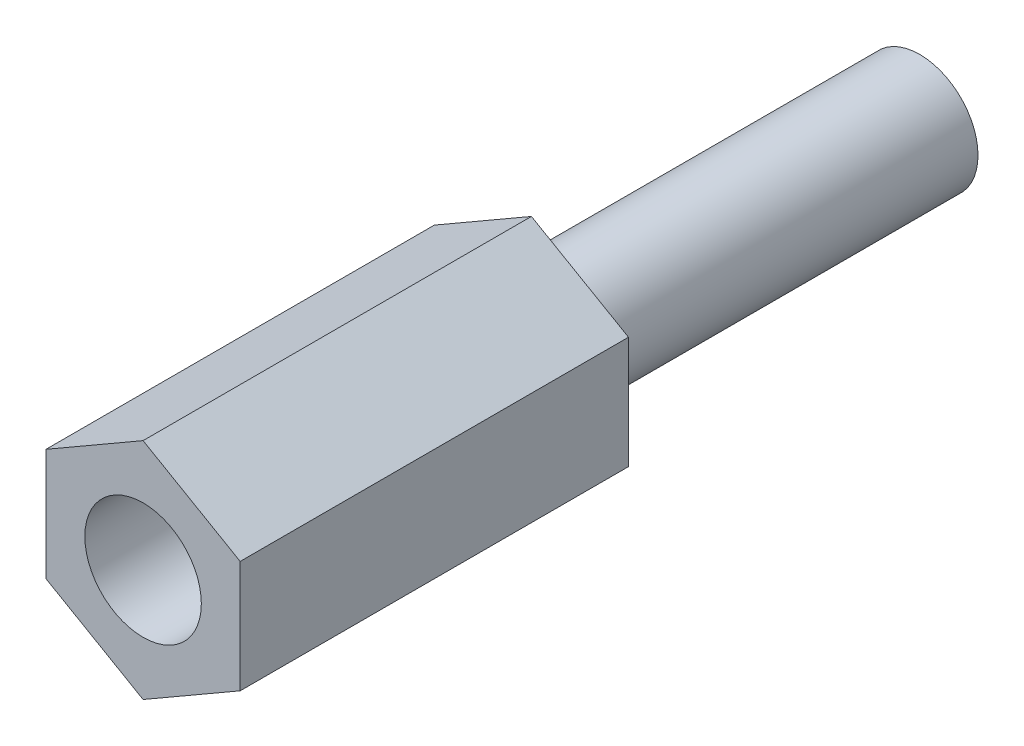
ISO-10303-21;
HEADER;
FILE_DESCRIPTION(('STEP AP214'),'2;1');
FILE_NAME('part.step','',(''),(''),'','','');
FILE_SCHEMA(('AUTOMOTIVE_DESIGN { 1 0 10303 214 1 1 1 1 }'));
ENDSEC;
DATA;
#1=APPLICATION_CONTEXT('core data for automotive mechanical design processes');
#2=APPLICATION_PROTOCOL_DEFINITION('international standard','automotive_design',2000,#1);
#3=PRODUCT_CONTEXT('',#1,'mechanical');
#4=PRODUCT('Part','Part','',(#3));
#5=PRODUCT_RELATED_PRODUCT_CATEGORY('part','',(#4));
#6=PRODUCT_DEFINITION_FORMATION('','',#4);
#7=PRODUCT_DEFINITION_CONTEXT('part definition',#1,'design');
#8=PRODUCT_DEFINITION('design','',#6,#7);
#9=PRODUCT_DEFINITION_SHAPE('','',#8);
#10=(LENGTH_UNIT() NAMED_UNIT(*) SI_UNIT(.MILLI.,.METRE.));
#11=(NAMED_UNIT(*) PLANE_ANGLE_UNIT() SI_UNIT($,.RADIAN.));
#12=(NAMED_UNIT(*) SI_UNIT($,.STERADIAN.) SOLID_ANGLE_UNIT());
#13=UNCERTAINTY_MEASURE_WITH_UNIT(LENGTH_MEASURE(1.E-05),#10,'distance_accuracy_value','');
#14=(GEOMETRIC_REPRESENTATION_CONTEXT(3) GLOBAL_UNCERTAINTY_ASSIGNED_CONTEXT((#13)) GLOBAL_UNIT_ASSIGNED_CONTEXT((#10,
#11,#12)) REPRESENTATION_CONTEXT('',''));
#15=CARTESIAN_POINT('',(0.,0.,0.));
#16=DIRECTION('',(0.,0.,1.));
#17=DIRECTION('',(1.,0.,0.));
#18=AXIS2_PLACEMENT_3D('',#15,#16,#17);
#19=CARTESIAN_POINT('',(0.,0.,10.));
#20=DIRECTION('',(0.,0.,-1.));
#21=DIRECTION('',(-1.,0.,0.));
#22=AXIS2_PLACEMENT_3D('',#19,#20,#21);
#23=CYLINDRICAL_SURFACE('',#22,1.5);
#24=CARTESIAN_POINT('',(0.,0.,10.));
#25=DIRECTION('',(0.,0.,1.));
#26=DIRECTION('',(1.,0.,0.));
#27=AXIS2_PLACEMENT_3D('',#24,#25,#26);
#28=CIRCLE('',#27,1.5);
#29=CARTESIAN_POINT('',(1.5,0.,10.));
#30=VERTEX_POINT('',#29);
#31=EDGE_CURVE('E143',#30,#30,#28,.T.);
#32=ORIENTED_EDGE('',*,*,#31,.T.);
#33=EDGE_LOOP('',(#32));
#34=FACE_BOUND('',#33,.T.);
#35=CARTESIAN_POINT('',(0.,0.,2.));
#36=DIRECTION('',(0.,0.,-1.));
#37=DIRECTION('',(-1.,0.,0.));
#38=AXIS2_PLACEMENT_3D('',#35,#36,#37);
#39=CIRCLE('',#38,1.5);
#40=CARTESIAN_POINT('',(-1.5,0.,2.));
#41=VERTEX_POINT('',#40);
#42=EDGE_CURVE('E249',#41,#41,#39,.T.);
#43=ORIENTED_EDGE('',*,*,#42,.T.);
#44=EDGE_LOOP('',(#43));
#45=FACE_BOUND('',#44,.T.);
#46=ADVANCED_FACE('F53',(#34,#45),#23,.F.);
#47=CARTESIAN_POINT('',(0.,0.,10.));
#48=DIRECTION('',(0.,0.,1.));
#49=DIRECTION('',(1.,0.,0.));
#50=AXIS2_PLACEMENT_3D('',#47,#48,#49);
#51=PLANE('',#50);
#52=DIRECTION('',(0.866025403784439,-0.5,0.));
#53=VECTOR('',#52,1.);
#54=CARTESIAN_POINT('',(-2.5,-1.44337567297406,10.));
#55=LINE('',#54,#53);
#56=CARTESIAN_POINT('',(-2.5,-1.44337567297406,10.));
#57=VERTEX_POINT('',#56);
#58=CARTESIAN_POINT('',(0.,-2.88675134594813,10.));
#59=VERTEX_POINT('',#58);
#60=EDGE_CURVE('E150',#57,#59,#55,.T.);
#61=ORIENTED_EDGE('',*,*,#60,.T.);
#62=DIRECTION('',(0.866025403784438,0.5,0.));
#63=VECTOR('',#62,1.);
#64=CARTESIAN_POINT('',(0.,-2.88675134594813,10.));
#65=LINE('',#64,#63);
#66=CARTESIAN_POINT('',(2.5,-1.44337567297406,10.));
#67=VERTEX_POINT('',#66);
#68=EDGE_CURVE('E107',#59,#67,#65,.T.);
#69=ORIENTED_EDGE('',*,*,#68,.T.);
#70=DIRECTION('',(0.,1.,0.));
#71=VECTOR('',#70,1.);
#72=CARTESIAN_POINT('',(2.5,-1.44337567297406,10.));
#73=LINE('',#72,#71);
#74=CARTESIAN_POINT('',(2.5,1.44337567297407,10.));
#75=VERTEX_POINT('',#74);
#76=EDGE_CURVE('E121',#67,#75,#73,.T.);
#77=ORIENTED_EDGE('',*,*,#76,.T.);
#78=DIRECTION('',(-0.866025403784439,0.5,0.));
#79=VECTOR('',#78,1.);
#80=CARTESIAN_POINT('',(2.5,1.44337567297407,10.));
#81=LINE('',#80,#79);
#82=CARTESIAN_POINT('',(0.,2.88675134594813,10.));
#83=VERTEX_POINT('',#82);
#84=EDGE_CURVE('E114',#75,#83,#81,.T.);
#85=ORIENTED_EDGE('',*,*,#84,.T.);
#86=DIRECTION('',(-0.866025403784439,-0.5,0.));
#87=VECTOR('',#86,1.);
#88=CARTESIAN_POINT('',(0.,2.88675134594813,10.));
#89=LINE('',#88,#87);
#90=CARTESIAN_POINT('',(-2.5,1.44337567297406,10.));
#91=VERTEX_POINT('',#90);
#92=EDGE_CURVE('E119',#83,#91,#89,.T.);
#93=ORIENTED_EDGE('',*,*,#92,.T.);
#94=DIRECTION('',(0.,-1.,0.));
#95=VECTOR('',#94,1.);
#96=CARTESIAN_POINT('',(-2.5,1.44337567297406,10.));
#97=LINE('',#96,#95);
#98=EDGE_CURVE('E70',#91,#57,#97,.T.);
#99=ORIENTED_EDGE('',*,*,#98,.T.);
#100=EDGE_LOOP('',(#61,#69,#77,#85,#93,#99));
#101=FACE_BOUND('',#100,.T.);
#102=ORIENTED_EDGE('',*,*,#31,.F.);
#103=EDGE_LOOP('',(#102));
#104=FACE_BOUND('',#103,.T.);
#105=ADVANCED_FACE('F116',(#101,#104),#51,.T.);
#106=CARTESIAN_POINT('',(0.,0.,0.));
#107=DIRECTION('',(0.,0.,1.));
#108=DIRECTION('',(1.,0.,0.));
#109=AXIS2_PLACEMENT_3D('',#106,#107,#108);
#110=PLANE('',#109);
#111=DIRECTION('',(0.866025403784439,-0.5,0.));
#112=VECTOR('',#111,1.);
#113=CARTESIAN_POINT('',(-2.5,-1.44337567297406,0.));
#114=LINE('',#113,#112);
#115=CARTESIAN_POINT('',(-2.5,-1.44337567297406,0.));
#116=VERTEX_POINT('',#115);
#117=CARTESIAN_POINT('',(0.,-2.88675134594813,0.));
#118=VERTEX_POINT('',#117);
#119=EDGE_CURVE('E139',#116,#118,#114,.T.);
#120=ORIENTED_EDGE('',*,*,#119,.F.);
#121=DIRECTION('',(0.,-1.,0.));
#122=VECTOR('',#121,1.);
#123=CARTESIAN_POINT('',(-2.5,1.44337567297406,0.));
#124=LINE('',#123,#122);
#125=CARTESIAN_POINT('',(-2.5,1.44337567297406,0.));
#126=VERTEX_POINT('',#125);
#127=EDGE_CURVE('E99',#126,#116,#124,.T.);
#128=ORIENTED_EDGE('',*,*,#127,.F.);
#129=DIRECTION('',(-0.866025403784439,-0.5,0.));
#130=VECTOR('',#129,1.);
#131=CARTESIAN_POINT('',(0.,2.88675134594813,0.));
#132=LINE('',#131,#130);
#133=CARTESIAN_POINT('',(0.,2.88675134594813,0.));
#134=VERTEX_POINT('',#133);
#135=EDGE_CURVE('E93',#134,#126,#132,.T.);
#136=ORIENTED_EDGE('',*,*,#135,.F.);
#137=DIRECTION('',(-0.866025403784439,0.5,0.));
#138=VECTOR('',#137,1.);
#139=CARTESIAN_POINT('',(2.5,1.44337567297407,0.));
#140=LINE('',#139,#138);
#141=CARTESIAN_POINT('',(2.5,1.44337567297407,0.));
#142=VERTEX_POINT('',#141);
#143=EDGE_CURVE('E129',#142,#134,#140,.T.);
#144=ORIENTED_EDGE('',*,*,#143,.F.);
#145=DIRECTION('',(0.,1.,0.));
#146=VECTOR('',#145,1.);
#147=CARTESIAN_POINT('',(2.5,-1.44337567297406,0.));
#148=LINE('',#147,#146);
#149=CARTESIAN_POINT('',(2.5,-1.44337567297406,0.));
#150=VERTEX_POINT('',#149);
#151=EDGE_CURVE('E145',#150,#142,#148,.T.);
#152=ORIENTED_EDGE('',*,*,#151,.F.);
#153=DIRECTION('',(0.866025403784438,0.5,0.));
#154=VECTOR('',#153,1.);
#155=CARTESIAN_POINT('',(0.,-2.88675134594813,0.));
#156=LINE('',#155,#154);
#157=EDGE_CURVE('E142',#118,#150,#156,.T.);
#158=ORIENTED_EDGE('',*,*,#157,.F.);
#159=EDGE_LOOP('',(#120,#128,#136,#144,#152,#158));
#160=FACE_BOUND('',#159,.T.);
#161=CARTESIAN_POINT('',(0.,0.,0.));
#162=DIRECTION('',(0.,0.,1.));
#163=DIRECTION('',(1.,0.,0.));
#164=AXIS2_PLACEMENT_3D('',#161,#162,#163);
#165=CIRCLE('',#164,1.5);
#166=CARTESIAN_POINT('',(1.5,0.,0.));
#167=VERTEX_POINT('',#166);
#168=EDGE_CURVE('E248',#167,#167,#165,.F.);
#169=ORIENTED_EDGE('',*,*,#168,.F.);
#170=EDGE_LOOP('',(#169));
#171=FACE_BOUND('',#170,.T.);
#172=ADVANCED_FACE('F159',(#160,#171),#110,.F.);
#173=CARTESIAN_POINT('',(-2.5,-1.44337567297406,10.));
#174=DIRECTION('',(0.5,0.866025403784439,0.));
#175=DIRECTION('',(-0.866025403784439,0.5,0.));
#176=AXIS2_PLACEMENT_3D('',#173,#174,#175);
#177=PLANE('',#176);
#178=ORIENTED_EDGE('',*,*,#119,.T.);
#179=DIRECTION('',(0.,0.,-1.));
#180=VECTOR('',#179,1.);
#181=CARTESIAN_POINT('',(0.,-2.88675134594813,10.));
#182=LINE('',#181,#180);
#183=EDGE_CURVE('E12',#59,#118,#182,.T.);
#184=ORIENTED_EDGE('',*,*,#183,.F.);
#185=ORIENTED_EDGE('',*,*,#60,.F.);
#186=DIRECTION('',(0.,0.,-1.));
#187=VECTOR('',#186,1.);
#188=CARTESIAN_POINT('',(-2.5,-1.44337567297406,10.));
#189=LINE('',#188,#187);
#190=EDGE_CURVE('E135',#57,#116,#189,.T.);
#191=ORIENTED_EDGE('',*,*,#190,.T.);
#192=EDGE_LOOP('',(#178,#184,#185,#191));
#193=FACE_BOUND('',#192,.T.);
#194=ADVANCED_FACE('F55',(#193),#177,.F.);
#195=CARTESIAN_POINT('',(0.,-2.88675134594813,10.));
#196=DIRECTION('',(-0.5,0.866025403784439,0.));
#197=DIRECTION('',(-0.866025403784439,-0.5,0.));
#198=AXIS2_PLACEMENT_3D('',#195,#196,#197);
#199=PLANE('',#198);
#200=ORIENTED_EDGE('',*,*,#157,.T.);
#201=DIRECTION('',(0.,0.,-1.));
#202=VECTOR('',#201,1.);
#203=CARTESIAN_POINT('',(2.5,-1.44337567297406,10.));
#204=LINE('',#203,#202);
#205=EDGE_CURVE('E62',#67,#150,#204,.T.);
#206=ORIENTED_EDGE('',*,*,#205,.F.);
#207=ORIENTED_EDGE('',*,*,#68,.F.);
#208=ORIENTED_EDGE('',*,*,#183,.T.);
#209=EDGE_LOOP('',(#200,#206,#207,#208));
#210=FACE_BOUND('',#209,.T.);
#211=ADVANCED_FACE('F192',(#210),#199,.F.);
#212=CARTESIAN_POINT('',(2.5,-1.44337567297406,10.));
#213=DIRECTION('',(-1.,0.,0.));
#214=DIRECTION('',(0.,-1.,0.));
#215=AXIS2_PLACEMENT_3D('',#212,#213,#214);
#216=PLANE('',#215);
#217=ORIENTED_EDGE('',*,*,#151,.T.);
#218=DIRECTION('',(0.,0.,-1.));
#219=VECTOR('',#218,1.);
#220=CARTESIAN_POINT('',(2.5,1.44337567297407,10.));
#221=LINE('',#220,#219);
#222=EDGE_CURVE('E130',#75,#142,#221,.T.);
#223=ORIENTED_EDGE('',*,*,#222,.F.);
#224=ORIENTED_EDGE('',*,*,#76,.F.);
#225=ORIENTED_EDGE('',*,*,#205,.T.);
#226=EDGE_LOOP('',(#217,#223,#224,#225));
#227=FACE_BOUND('',#226,.T.);
#228=ADVANCED_FACE('F156',(#227),#216,.F.);
#229=CARTESIAN_POINT('',(2.5,1.44337567297407,10.));
#230=DIRECTION('',(-0.5,-0.866025403784439,0.));
#231=DIRECTION('',(0.866025403784439,-0.5,0.));
#232=AXIS2_PLACEMENT_3D('',#229,#230,#231);
#233=PLANE('',#232);
#234=ORIENTED_EDGE('',*,*,#143,.T.);
#235=DIRECTION('',(0.,0.,-1.));
#236=VECTOR('',#235,1.);
#237=CARTESIAN_POINT('',(0.,2.88675134594813,10.));
#238=LINE('',#237,#236);
#239=EDGE_CURVE('E126',#83,#134,#238,.T.);
#240=ORIENTED_EDGE('',*,*,#239,.F.);
#241=ORIENTED_EDGE('',*,*,#84,.F.);
#242=ORIENTED_EDGE('',*,*,#222,.T.);
#243=EDGE_LOOP('',(#234,#240,#241,#242));
#244=FACE_BOUND('',#243,.T.);
#245=ADVANCED_FACE('F127',(#244),#233,.F.);
#246=CARTESIAN_POINT('',(0.,2.88675134594813,10.));
#247=DIRECTION('',(0.5,-0.866025403784439,0.));
#248=DIRECTION('',(0.866025403784439,0.5,0.));
#249=AXIS2_PLACEMENT_3D('',#246,#247,#248);
#250=PLANE('',#249);
#251=ORIENTED_EDGE('',*,*,#135,.T.);
#252=DIRECTION('',(0.,0.,-1.));
#253=VECTOR('',#252,1.);
#254=CARTESIAN_POINT('',(-2.5,1.44337567297406,10.));
#255=LINE('',#254,#253);
#256=EDGE_CURVE('E131',#91,#126,#255,.T.);
#257=ORIENTED_EDGE('',*,*,#256,.F.);
#258=ORIENTED_EDGE('',*,*,#92,.F.);
#259=ORIENTED_EDGE('',*,*,#239,.T.);
#260=EDGE_LOOP('',(#251,#257,#258,#259));
#261=FACE_BOUND('',#260,.T.);
#262=ADVANCED_FACE('F133',(#261),#250,.F.);
#263=CARTESIAN_POINT('',(-2.5,1.44337567297406,10.));
#264=DIRECTION('',(1.,0.,0.));
#265=DIRECTION('',(0.,1.,0.));
#266=AXIS2_PLACEMENT_3D('',#263,#264,#265);
#267=PLANE('',#266);
#268=ORIENTED_EDGE('',*,*,#127,.T.);
#269=ORIENTED_EDGE('',*,*,#190,.F.);
#270=ORIENTED_EDGE('',*,*,#98,.F.);
#271=ORIENTED_EDGE('',*,*,#256,.T.);
#272=EDGE_LOOP('',(#268,#269,#270,#271));
#273=FACE_BOUND('',#272,.T.);
#274=ADVANCED_FACE('F164',(#273),#267,.F.);
#275=CARTESIAN_POINT('',(0.,0.,2.));
#276=DIRECTION('',(0.,0.,-1.));
#277=DIRECTION('',(-1.,0.,0.));
#278=AXIS2_PLACEMENT_3D('',#275,#276,#277);
#279=PLANE('',#278);
#280=ORIENTED_EDGE('',*,*,#42,.F.);
#281=EDGE_LOOP('',(#280));
#282=FACE_BOUND('',#281,.T.);
#283=ADVANCED_FACE('F166',(#282),#279,.F.);
#284=CARTESIAN_POINT('',(0.,0.,-10.));
#285=DIRECTION('',(0.,0.,1.));
#286=DIRECTION('',(1.,0.,0.));
#287=AXIS2_PLACEMENT_3D('',#284,#285,#286);
#288=CYLINDRICAL_SURFACE('',#287,1.5);
#289=CARTESIAN_POINT('',(0.,0.,-10.));
#290=DIRECTION('',(0.,0.,-1.));
#291=DIRECTION('',(-1.,0.,0.));
#292=AXIS2_PLACEMENT_3D('',#289,#290,#291);
#293=CIRCLE('',#292,1.5);
#294=CARTESIAN_POINT('',(-1.5,0.,-10.));
#295=VERTEX_POINT('',#294);
#296=EDGE_CURVE('E247',#295,#295,#293,.T.);
#297=ORIENTED_EDGE('',*,*,#296,.F.);
#298=EDGE_LOOP('',(#297));
#299=FACE_BOUND('',#298,.T.);
#300=ORIENTED_EDGE('',*,*,#168,.T.);
#301=EDGE_LOOP('',(#300));
#302=FACE_BOUND('',#301,.T.);
#303=ADVANCED_FACE('F172',(#299,#302),#288,.T.);
#304=CARTESIAN_POINT('',(0.,0.,-10.));
#305=DIRECTION('',(0.,0.,-1.));
#306=DIRECTION('',(-1.,0.,0.));
#307=AXIS2_PLACEMENT_3D('',#304,#305,#306);
#308=PLANE('',#307);
#309=ORIENTED_EDGE('',*,*,#296,.T.);
#310=EDGE_LOOP('',(#309));
#311=FACE_BOUND('',#310,.T.);
#312=ADVANCED_FACE('F233',(#311),#308,.T.);
#313=CLOSED_SHELL('',(#46,#105,#172,#194,#211,#228,#245,#262,#274,#283,#303,#312));
#314=MANIFOLD_SOLID_BREP('B2',#313);
#315=ADVANCED_BREP_SHAPE_REPRESENTATION('',(#18,#314),#14);
#316=SHAPE_DEFINITION_REPRESENTATION(#9,#315);
ENDSEC;
END-ISO-10303-21;
